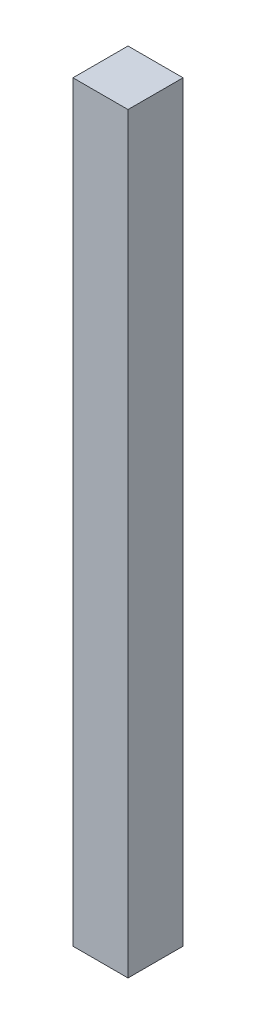
ISO-10303-21;
HEADER;
FILE_DESCRIPTION(('STEP AP214'),'2;1');
FILE_NAME('part.step','',(''),(''),'','','');
FILE_SCHEMA(('AUTOMOTIVE_DESIGN { 1 0 10303 214 1 1 1 1 }'));
ENDSEC;
DATA;
#1=APPLICATION_CONTEXT('core data for automotive mechanical design processes');
#2=APPLICATION_PROTOCOL_DEFINITION('international standard','automotive_design',2000,#1);
#3=PRODUCT_CONTEXT('',#1,'mechanical');
#4=PRODUCT('Part','Part','',(#3));
#5=PRODUCT_RELATED_PRODUCT_CATEGORY('part','',(#4));
#6=PRODUCT_DEFINITION_FORMATION('','',#4);
#7=PRODUCT_DEFINITION_CONTEXT('part definition',#1,'design');
#8=PRODUCT_DEFINITION('design','',#6,#7);
#9=PRODUCT_DEFINITION_SHAPE('','',#8);
#10=(LENGTH_UNIT() NAMED_UNIT(*) SI_UNIT(.MILLI.,.METRE.));
#11=(NAMED_UNIT(*) PLANE_ANGLE_UNIT() SI_UNIT($,.RADIAN.));
#12=(NAMED_UNIT(*) SI_UNIT($,.STERADIAN.) SOLID_ANGLE_UNIT());
#13=UNCERTAINTY_MEASURE_WITH_UNIT(LENGTH_MEASURE(1.E-05),#10,'distance_accuracy_value','');
#14=(GEOMETRIC_REPRESENTATION_CONTEXT(3) GLOBAL_UNCERTAINTY_ASSIGNED_CONTEXT((#13)) GLOBAL_UNIT_ASSIGNED_CONTEXT((#10,
#11,#12)) REPRESENTATION_CONTEXT('',''));
#15=CARTESIAN_POINT('',(0.,0.,0.));
#16=DIRECTION('',(0.,0.,1.));
#17=DIRECTION('',(1.,0.,0.));
#18=AXIS2_PLACEMENT_3D('',#15,#16,#17);
#19=CARTESIAN_POINT('',(0.,520.7,0.));
#20=DIRECTION('',(1.,0.,0.));
#21=DIRECTION('',(0.,0.,-1.));
#22=AXIS2_PLACEMENT_3D('',#19,#20,#21);
#23=PLANE('',#22);
#24=DIRECTION('',(0.,0.,1.));
#25=VECTOR('',#24,1.);
#26=CARTESIAN_POINT('',(0.,0.,0.));
#27=LINE('',#26,#25);
#28=CARTESIAN_POINT('',(0.,0.,0.));
#29=VERTEX_POINT('',#28);
#30=CARTESIAN_POINT('',(0.,0.,38.1));
#31=VERTEX_POINT('',#30);
#32=EDGE_CURVE('E96',#29,#31,#27,.T.);
#33=ORIENTED_EDGE('',*,*,#32,.T.);
#34=DIRECTION('',(0.,-1.,0.));
#35=VECTOR('',#34,1.);
#36=CARTESIAN_POINT('',(0.,520.7,38.1));
#37=LINE('',#36,#35);
#38=CARTESIAN_POINT('',(0.,520.7,38.1));
#39=VERTEX_POINT('',#38);
#40=EDGE_CURVE('E11',#39,#31,#37,.T.);
#41=ORIENTED_EDGE('',*,*,#40,.F.);
#42=DIRECTION('',(0.,0.,1.));
#43=VECTOR('',#42,1.);
#44=CARTESIAN_POINT('',(0.,520.7,0.));
#45=LINE('',#44,#43);
#46=CARTESIAN_POINT('',(0.,520.7,0.));
#47=VERTEX_POINT('',#46);
#48=EDGE_CURVE('E84',#47,#39,#45,.T.);
#49=ORIENTED_EDGE('',*,*,#48,.F.);
#50=DIRECTION('',(0.,-1.,0.));
#51=VECTOR('',#50,1.);
#52=CARTESIAN_POINT('',(0.,520.7,0.));
#53=LINE('',#52,#51);
#54=EDGE_CURVE('E92',#47,#29,#53,.T.);
#55=ORIENTED_EDGE('',*,*,#54,.T.);
#56=EDGE_LOOP('',(#33,#41,#49,#55));
#57=FACE_BOUND('',#56,.T.);
#58=ADVANCED_FACE('F33',(#57),#23,.F.);
#59=CARTESIAN_POINT('',(0.,520.7,38.1));
#60=DIRECTION('',(0.,0.,-1.));
#61=DIRECTION('',(-1.,0.,0.));
#62=AXIS2_PLACEMENT_3D('',#59,#60,#61);
#63=PLANE('',#62);
#64=DIRECTION('',(1.,0.,0.));
#65=VECTOR('',#64,1.);
#66=CARTESIAN_POINT('',(0.,0.,38.1));
#67=LINE('',#66,#65);
#68=CARTESIAN_POINT('',(38.1,0.,38.1));
#69=VERTEX_POINT('',#68);
#70=EDGE_CURVE('E88',#31,#69,#67,.T.);
#71=ORIENTED_EDGE('',*,*,#70,.T.);
#72=DIRECTION('',(0.,-1.,0.));
#73=VECTOR('',#72,1.);
#74=CARTESIAN_POINT('',(38.1,520.7,38.1));
#75=LINE('',#74,#73);
#76=CARTESIAN_POINT('',(38.1,520.7,38.1));
#77=VERTEX_POINT('',#76);
#78=EDGE_CURVE('E41',#77,#69,#75,.T.);
#79=ORIENTED_EDGE('',*,*,#78,.F.);
#80=DIRECTION('',(1.,0.,0.));
#81=VECTOR('',#80,1.);
#82=CARTESIAN_POINT('',(0.,520.7,38.1));
#83=LINE('',#82,#81);
#84=EDGE_CURVE('E79',#39,#77,#83,.T.);
#85=ORIENTED_EDGE('',*,*,#84,.F.);
#86=ORIENTED_EDGE('',*,*,#40,.T.);
#87=EDGE_LOOP('',(#71,#79,#85,#86));
#88=FACE_BOUND('',#87,.T.);
#89=ADVANCED_FACE('F87',(#88),#63,.F.);
#90=CARTESIAN_POINT('',(38.1,520.7,0.));
#91=DIRECTION('',(-1.,0.,0.));
#92=DIRECTION('',(0.,0.,1.));
#93=AXIS2_PLACEMENT_3D('',#90,#91,#92);
#94=PLANE('',#93);
#95=DIRECTION('',(0.,0.,-1.));
#96=VECTOR('',#95,1.);
#97=CARTESIAN_POINT('',(38.1,0.,0.));
#98=LINE('',#97,#96);
#99=CARTESIAN_POINT('',(38.1,0.,0.));
#100=VERTEX_POINT('',#99);
#101=EDGE_CURVE('E66',#69,#100,#98,.T.);
#102=ORIENTED_EDGE('',*,*,#101,.T.);
#103=DIRECTION('',(0.,-1.,0.));
#104=VECTOR('',#103,1.);
#105=CARTESIAN_POINT('',(38.1,520.7,0.));
#106=LINE('',#105,#104);
#107=CARTESIAN_POINT('',(38.1,520.7,0.));
#108=VERTEX_POINT('',#107);
#109=EDGE_CURVE('E89',#108,#100,#106,.T.);
#110=ORIENTED_EDGE('',*,*,#109,.F.);
#111=DIRECTION('',(0.,0.,-1.));
#112=VECTOR('',#111,1.);
#113=CARTESIAN_POINT('',(38.1,520.7,0.));
#114=LINE('',#113,#112);
#115=EDGE_CURVE('E82',#77,#108,#114,.T.);
#116=ORIENTED_EDGE('',*,*,#115,.F.);
#117=ORIENTED_EDGE('',*,*,#78,.T.);
#118=EDGE_LOOP('',(#102,#110,#116,#117));
#119=FACE_BOUND('',#118,.T.);
#120=ADVANCED_FACE('F90',(#119),#94,.F.);
#121=CARTESIAN_POINT('',(0.,520.7,0.));
#122=DIRECTION('',(0.,0.,1.));
#123=DIRECTION('',(1.,0.,0.));
#124=AXIS2_PLACEMENT_3D('',#121,#122,#123);
#125=PLANE('',#124);
#126=DIRECTION('',(-1.,0.,0.));
#127=VECTOR('',#126,1.);
#128=CARTESIAN_POINT('',(0.,0.,0.));
#129=LINE('',#128,#127);
#130=EDGE_CURVE('E72',#100,#29,#129,.T.);
#131=ORIENTED_EDGE('',*,*,#130,.T.);
#132=ORIENTED_EDGE('',*,*,#54,.F.);
#133=DIRECTION('',(-1.,0.,0.));
#134=VECTOR('',#133,1.);
#135=CARTESIAN_POINT('',(0.,520.7,0.));
#136=LINE('',#135,#134);
#137=EDGE_CURVE('E49',#108,#47,#136,.T.);
#138=ORIENTED_EDGE('',*,*,#137,.F.);
#139=ORIENTED_EDGE('',*,*,#109,.T.);
#140=EDGE_LOOP('',(#131,#132,#138,#139));
#141=FACE_BOUND('',#140,.T.);
#142=ADVANCED_FACE('F103',(#141),#125,.F.);
#143=CARTESIAN_POINT('',(0.,520.7,0.));
#144=DIRECTION('',(0.,1.,0.));
#145=DIRECTION('',(0.,0.,1.));
#146=AXIS2_PLACEMENT_3D('',#143,#144,#145);
#147=PLANE('',#146);
#148=ORIENTED_EDGE('',*,*,#48,.T.);
#149=ORIENTED_EDGE('',*,*,#84,.T.);
#150=ORIENTED_EDGE('',*,*,#115,.T.);
#151=ORIENTED_EDGE('',*,*,#137,.T.);
#152=EDGE_LOOP('',(#148,#149,#150,#151));
#153=FACE_BOUND('',#152,.T.);
#154=ADVANCED_FACE('F80',(#153),#147,.T.);
#155=CARTESIAN_POINT('',(0.,0.,0.));
#156=DIRECTION('',(0.,1.,0.));
#157=DIRECTION('',(0.,0.,1.));
#158=AXIS2_PLACEMENT_3D('',#155,#156,#157);
#159=PLANE('',#158);
#160=ORIENTED_EDGE('',*,*,#32,.F.);
#161=ORIENTED_EDGE('',*,*,#130,.F.);
#162=ORIENTED_EDGE('',*,*,#101,.F.);
#163=ORIENTED_EDGE('',*,*,#70,.F.);
#164=EDGE_LOOP('',(#160,#161,#162,#163));
#165=FACE_BOUND('',#164,.T.);
#166=ADVANCED_FACE('F106',(#165),#159,.F.);
#167=CLOSED_SHELL('',(#58,#89,#120,#142,#154,#166));
#168=MANIFOLD_SOLID_BREP('B2',#167);
#169=ADVANCED_BREP_SHAPE_REPRESENTATION('',(#18,#168),#14);
#170=SHAPE_DEFINITION_REPRESENTATION(#9,#169);
ENDSEC;
END-ISO-10303-21;
